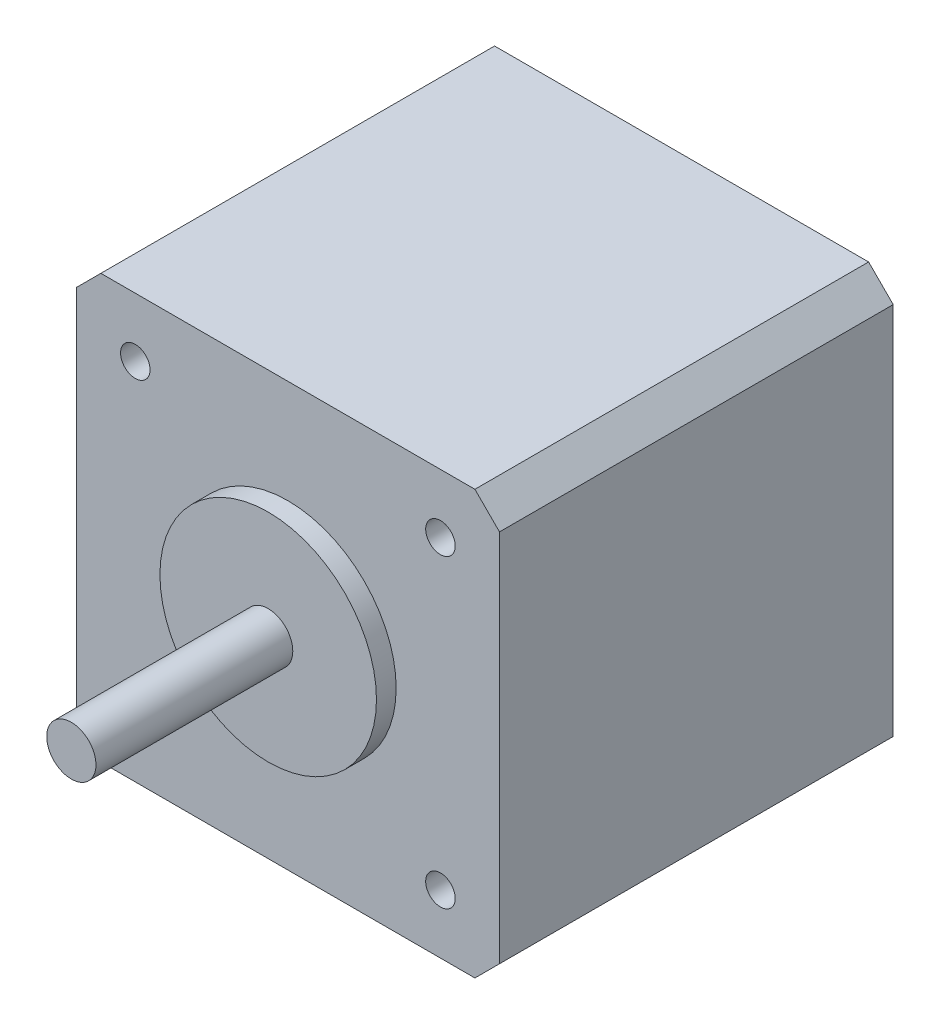
ISO-10303-21;
HEADER;
FILE_DESCRIPTION(('STEP AP214'),'2;1');
FILE_NAME('part.step','',(''),(''),'','','');
FILE_SCHEMA(('AUTOMOTIVE_DESIGN { 1 0 10303 214 1 1 1 1 }'));
ENDSEC;
DATA;
#1=APPLICATION_CONTEXT('core data for automotive mechanical design processes');
#2=APPLICATION_PROTOCOL_DEFINITION('international standard','automotive_design',2000,#1);
#3=PRODUCT_CONTEXT('',#1,'mechanical');
#4=PRODUCT('Part','Part','',(#3));
#5=PRODUCT_RELATED_PRODUCT_CATEGORY('part','',(#4));
#6=PRODUCT_DEFINITION_FORMATION('','',#4);
#7=PRODUCT_DEFINITION_CONTEXT('part definition',#1,'design');
#8=PRODUCT_DEFINITION('design','',#6,#7);
#9=PRODUCT_DEFINITION_SHAPE('','',#8);
#10=(LENGTH_UNIT() NAMED_UNIT(*) SI_UNIT(.MILLI.,.METRE.));
#11=(NAMED_UNIT(*) PLANE_ANGLE_UNIT() SI_UNIT($,.RADIAN.));
#12=(NAMED_UNIT(*) SI_UNIT($,.STERADIAN.) SOLID_ANGLE_UNIT());
#13=UNCERTAINTY_MEASURE_WITH_UNIT(LENGTH_MEASURE(1.E-05),#10,'distance_accuracy_value','');
#14=(GEOMETRIC_REPRESENTATION_CONTEXT(3) GLOBAL_UNCERTAINTY_ASSIGNED_CONTEXT((#13)) GLOBAL_UNIT_ASSIGNED_CONTEXT((#10,
#11,#12)) REPRESENTATION_CONTEXT('',''));
#15=CARTESIAN_POINT('',(0.,0.,0.));
#16=DIRECTION('',(0.,0.,1.));
#17=DIRECTION('',(1.,0.,0.));
#18=AXIS2_PLACEMENT_3D('',#15,#16,#17);
#19=CARTESIAN_POINT('',(0.,0.,42.));
#20=DIRECTION('',(0.,0.,1.));
#21=DIRECTION('',(1.,0.,0.));
#22=AXIS2_PLACEMENT_3D('',#19,#20,#21);
#23=PLANE('',#22);
#24=CARTESIAN_POINT('',(0.,0.,42.));
#25=DIRECTION('',(0.,0.,1.));
#26=DIRECTION('',(1.,0.,0.));
#27=AXIS2_PLACEMENT_3D('',#24,#25,#26);
#28=CIRCLE('',#27,11.);
#29=CARTESIAN_POINT('',(11.,0.,42.));
#30=VERTEX_POINT('',#29);
#31=EDGE_CURVE('E163',#30,#30,#28,.T.);
#32=ORIENTED_EDGE('',*,*,#31,.T.);
#33=EDGE_LOOP('',(#32));
#34=FACE_BOUND('',#33,.T.);
#35=CARTESIAN_POINT('',(0.,0.,42.));
#36=DIRECTION('',(0.,0.,1.));
#37=DIRECTION('',(1.,0.,0.));
#38=AXIS2_PLACEMENT_3D('',#35,#36,#37);
#39=CIRCLE('',#38,2.5);
#40=CARTESIAN_POINT('',(2.5,0.,42.));
#41=VERTEX_POINT('',#40);
#42=EDGE_CURVE('E174',#41,#41,#39,.T.);
#43=ORIENTED_EDGE('',*,*,#42,.F.);
#44=EDGE_LOOP('',(#43));
#45=FACE_BOUND('',#44,.T.);
#46=ADVANCED_FACE('F34',(#34,#45),#23,.T.);
#47=CARTESIAN_POINT('',(21.5,21.5,40.));
#48=DIRECTION('',(0.,0.,-1.));
#49=DIRECTION('',(-1.,0.,0.));
#50=AXIS2_PLACEMENT_3D('',#47,#48,#49);
#51=PLANE('',#50);
#52=CARTESIAN_POINT('',(-15.4999999999995,-15.5,40.));
#53=DIRECTION('',(0.,0.,1.));
#54=DIRECTION('',(1.,0.,0.));
#55=AXIS2_PLACEMENT_3D('',#52,#53,#54);
#56=CIRCLE('',#55,1.50000000000035);
#57=CARTESIAN_POINT('',(-13.9999999999992,-15.5,40.));
#58=VERTEX_POINT('',#57);
#59=EDGE_CURVE('E198',#58,#58,#56,.T.);
#60=ORIENTED_EDGE('',*,*,#59,.F.);
#61=EDGE_LOOP('',(#60));
#62=FACE_BOUND('',#61,.T.);
#63=CARTESIAN_POINT('',(15.5000000000005,-15.4999999999995,40.));
#64=DIRECTION('',(0.,0.,1.));
#65=DIRECTION('',(1.,0.,0.));
#66=AXIS2_PLACEMENT_3D('',#63,#64,#65);
#67=CIRCLE('',#66,1.50000000000035);
#68=CARTESIAN_POINT('',(17.0000000000008,-15.4999999999995,40.));
#69=VERTEX_POINT('',#68);
#70=EDGE_CURVE('E192',#69,#69,#67,.T.);
#71=ORIENTED_EDGE('',*,*,#70,.F.);
#72=EDGE_LOOP('',(#71));
#73=FACE_BOUND('',#72,.T.);
#74=CARTESIAN_POINT('',(15.5,15.5000000000005,40.));
#75=DIRECTION('',(0.,0.,1.));
#76=DIRECTION('',(1.,0.,0.));
#77=AXIS2_PLACEMENT_3D('',#74,#75,#76);
#78=CIRCLE('',#77,1.50000000000035);
#79=CARTESIAN_POINT('',(17.0000000000003,15.5000000000005,40.));
#80=VERTEX_POINT('',#79);
#81=EDGE_CURVE('E186',#80,#80,#78,.T.);
#82=ORIENTED_EDGE('',*,*,#81,.F.);
#83=EDGE_LOOP('',(#82));
#84=FACE_BOUND('',#83,.T.);
#85=CARTESIAN_POINT('',(-15.5,15.5,40.));
#86=DIRECTION('',(0.,0.,1.));
#87=DIRECTION('',(1.,0.,0.));
#88=AXIS2_PLACEMENT_3D('',#85,#86,#87);
#89=CIRCLE('',#88,1.50000000000035);
#90=CARTESIAN_POINT('',(-13.9999999999996,15.5,40.));
#91=VERTEX_POINT('',#90);
#92=EDGE_CURVE('E180',#91,#91,#89,.T.);
#93=ORIENTED_EDGE('',*,*,#92,.F.);
#94=EDGE_LOOP('',(#93));
#95=FACE_BOUND('',#94,.T.);
#96=DIRECTION('',(0.,-1.,0.));
#97=VECTOR('',#96,1.);
#98=CARTESIAN_POINT('',(-21.5,-21.5,40.));
#99=LINE('',#98,#97);
#100=CARTESIAN_POINT('',(-21.5,19.,40.));
#101=VERTEX_POINT('',#100);
#102=CARTESIAN_POINT('',(-21.5,-19.,40.));
#103=VERTEX_POINT('',#102);
#104=EDGE_CURVE('E167',#101,#103,#99,.T.);
#105=ORIENTED_EDGE('',*,*,#104,.T.);
#106=DIRECTION('',(-0.707106781186547,0.707106781186549,0.));
#107=VECTOR('',#106,1.);
#108=CARTESIAN_POINT('',(-19.,-21.5,40.));
#109=LINE('',#108,#107);
#110=CARTESIAN_POINT('',(-19.,-21.5,40.));
#111=VERTEX_POINT('',#110);
#112=EDGE_CURVE('E148',#103,#111,#109,.F.);
#113=ORIENTED_EDGE('',*,*,#112,.T.);
#114=DIRECTION('',(1.,0.,0.));
#115=VECTOR('',#114,1.);
#116=CARTESIAN_POINT('',(-21.5,-21.5,40.));
#117=LINE('',#116,#115);
#118=CARTESIAN_POINT('',(19.,-21.5,40.));
#119=VERTEX_POINT('',#118);
#120=EDGE_CURVE('E120',#111,#119,#117,.T.);
#121=ORIENTED_EDGE('',*,*,#120,.T.);
#122=DIRECTION('',(-0.707106781186549,-0.707106781186547,0.));
#123=VECTOR('',#122,1.);
#124=CARTESIAN_POINT('',(21.5,-19.,40.));
#125=LINE('',#124,#123);
#126=CARTESIAN_POINT('',(21.5,-19.,40.));
#127=VERTEX_POINT('',#126);
#128=EDGE_CURVE('E146',#119,#127,#125,.F.);
#129=ORIENTED_EDGE('',*,*,#128,.T.);
#130=DIRECTION('',(0.,1.,0.));
#131=VECTOR('',#130,1.);
#132=CARTESIAN_POINT('',(21.5,-21.5,40.));
#133=LINE('',#132,#131);
#134=CARTESIAN_POINT('',(21.5,19.,40.));
#135=VERTEX_POINT('',#134);
#136=EDGE_CURVE('E126',#127,#135,#133,.T.);
#137=ORIENTED_EDGE('',*,*,#136,.T.);
#138=DIRECTION('',(0.707106781186547,-0.707106781186549,0.));
#139=VECTOR('',#138,1.);
#140=CARTESIAN_POINT('',(19.,21.5,40.));
#141=LINE('',#140,#139);
#142=CARTESIAN_POINT('',(19.,21.5,40.));
#143=VERTEX_POINT('',#142);
#144=EDGE_CURVE('E55',#135,#143,#141,.F.);
#145=ORIENTED_EDGE('',*,*,#144,.T.);
#146=DIRECTION('',(-1.,0.,0.));
#147=VECTOR('',#146,1.);
#148=CARTESIAN_POINT('',(-21.5,21.5,40.));
#149=LINE('',#148,#147);
#150=CARTESIAN_POINT('',(-19.,21.5,40.));
#151=VERTEX_POINT('',#150);
#152=EDGE_CURVE('E129',#143,#151,#149,.T.);
#153=ORIENTED_EDGE('',*,*,#152,.T.);
#154=DIRECTION('',(0.707106781186549,0.707106781186547,0.));
#155=VECTOR('',#154,1.);
#156=CARTESIAN_POINT('',(-21.5,19.,40.));
#157=LINE('',#156,#155);
#158=EDGE_CURVE('E144',#151,#101,#157,.F.);
#159=ORIENTED_EDGE('',*,*,#158,.T.);
#160=EDGE_LOOP('',(#105,#113,#121,#129,#137,#145,#153,#159));
#161=FACE_BOUND('',#160,.T.);
#162=CARTESIAN_POINT('',(0.,0.,40.));
#163=DIRECTION('',(0.,0.,-1.));
#164=DIRECTION('',(-1.,0.,0.));
#165=AXIS2_PLACEMENT_3D('',#162,#163,#164);
#166=CIRCLE('',#165,11.);
#167=CARTESIAN_POINT('',(-11.,0.,40.));
#168=VERTEX_POINT('',#167);
#169=EDGE_CURVE('E11',#168,#168,#166,.F.);
#170=ORIENTED_EDGE('',*,*,#169,.F.);
#171=EDGE_LOOP('',(#170));
#172=FACE_BOUND('',#171,.T.);
#173=ADVANCED_FACE('F213',(#62,#73,#84,#95,#161,#172),#51,.F.);
#174=CARTESIAN_POINT('',(21.5,-21.5,40.));
#175=DIRECTION('',(-1.,0.,0.));
#176=DIRECTION('',(0.,0.,1.));
#177=AXIS2_PLACEMENT_3D('',#174,#175,#176);
#178=PLANE('',#177);
#179=ORIENTED_EDGE('',*,*,#136,.F.);
#180=DIRECTION('',(0.,0.,-1.));
#181=VECTOR('',#180,1.);
#182=CARTESIAN_POINT('',(21.5,-19.,40.));
#183=LINE('',#182,#181);
#184=CARTESIAN_POINT('',(21.5,-19.,0.));
#185=VERTEX_POINT('',#184);
#186=EDGE_CURVE('E152',#127,#185,#183,.T.);
#187=ORIENTED_EDGE('',*,*,#186,.T.);
#188=DIRECTION('',(0.,1.,0.));
#189=VECTOR('',#188,1.);
#190=CARTESIAN_POINT('',(21.5,-21.5,0.));
#191=LINE('',#190,#189);
#192=CARTESIAN_POINT('',(21.5,19.,0.));
#193=VERTEX_POINT('',#192);
#194=EDGE_CURVE('E162',#185,#193,#191,.T.);
#195=ORIENTED_EDGE('',*,*,#194,.T.);
#196=DIRECTION('',(0.,0.,1.));
#197=VECTOR('',#196,1.);
#198=CARTESIAN_POINT('',(21.5,19.,40.));
#199=LINE('',#198,#197);
#200=EDGE_CURVE('E150',#193,#135,#199,.T.);
#201=ORIENTED_EDGE('',*,*,#200,.T.);
#202=EDGE_LOOP('',(#179,#187,#195,#201));
#203=FACE_BOUND('',#202,.T.);
#204=ADVANCED_FACE('F216',(#203),#178,.F.);
#205=CARTESIAN_POINT('',(-21.5,21.5,40.));
#206=DIRECTION('',(0.,-1.,0.));
#207=DIRECTION('',(0.,0.,-1.));
#208=AXIS2_PLACEMENT_3D('',#205,#206,#207);
#209=PLANE('',#208);
#210=DIRECTION('',(-1.,0.,0.));
#211=VECTOR('',#210,1.);
#212=CARTESIAN_POINT('',(-21.5,21.5,0.));
#213=LINE('',#212,#211);
#214=CARTESIAN_POINT('',(19.,21.5,0.));
#215=VERTEX_POINT('',#214);
#216=CARTESIAN_POINT('',(-19.,21.5,0.));
#217=VERTEX_POINT('',#216);
#218=EDGE_CURVE('E131',#215,#217,#213,.T.);
#219=ORIENTED_EDGE('',*,*,#218,.T.);
#220=DIRECTION('',(0.,0.,1.));
#221=VECTOR('',#220,1.);
#222=CARTESIAN_POINT('',(-19.,21.5,40.));
#223=LINE('',#222,#221);
#224=EDGE_CURVE('E42',#217,#151,#223,.T.);
#225=ORIENTED_EDGE('',*,*,#224,.T.);
#226=ORIENTED_EDGE('',*,*,#152,.F.);
#227=DIRECTION('',(0.,0.,-1.));
#228=VECTOR('',#227,1.);
#229=CARTESIAN_POINT('',(19.,21.5,40.));
#230=LINE('',#229,#228);
#231=EDGE_CURVE('E155',#143,#215,#230,.T.);
#232=ORIENTED_EDGE('',*,*,#231,.T.);
#233=EDGE_LOOP('',(#219,#225,#226,#232));
#234=FACE_BOUND('',#233,.T.);
#235=ADVANCED_FACE('F159',(#234),#209,.F.);
#236=CARTESIAN_POINT('',(-21.5,-21.5,40.));
#237=DIRECTION('',(1.,0.,0.));
#238=DIRECTION('',(0.,0.,-1.));
#239=AXIS2_PLACEMENT_3D('',#236,#237,#238);
#240=PLANE('',#239);
#241=DIRECTION('',(0.,-1.,0.));
#242=VECTOR('',#241,1.);
#243=CARTESIAN_POINT('',(-21.5,-21.5,0.));
#244=LINE('',#243,#242);
#245=CARTESIAN_POINT('',(-21.5,19.,0.));
#246=VERTEX_POINT('',#245);
#247=CARTESIAN_POINT('',(-21.5,-19.,0.));
#248=VERTEX_POINT('',#247);
#249=EDGE_CURVE('E127',#246,#248,#244,.T.);
#250=ORIENTED_EDGE('',*,*,#249,.T.);
#251=DIRECTION('',(0.,0.,1.));
#252=VECTOR('',#251,1.);
#253=CARTESIAN_POINT('',(-21.5,-19.,40.));
#254=LINE('',#253,#252);
#255=EDGE_CURVE('E105',#248,#103,#254,.T.);
#256=ORIENTED_EDGE('',*,*,#255,.T.);
#257=ORIENTED_EDGE('',*,*,#104,.F.);
#258=DIRECTION('',(0.,0.,-1.));
#259=VECTOR('',#258,1.);
#260=CARTESIAN_POINT('',(-21.5,19.,40.));
#261=LINE('',#260,#259);
#262=EDGE_CURVE('E110',#101,#246,#261,.T.);
#263=ORIENTED_EDGE('',*,*,#262,.T.);
#264=EDGE_LOOP('',(#250,#256,#257,#263));
#265=FACE_BOUND('',#264,.T.);
#266=ADVANCED_FACE('F339',(#265),#240,.F.);
#267=CARTESIAN_POINT('',(-21.5,-21.5,40.));
#268=DIRECTION('',(0.,1.,0.));
#269=DIRECTION('',(0.,0.,1.));
#270=AXIS2_PLACEMENT_3D('',#267,#268,#269);
#271=PLANE('',#270);
#272=ORIENTED_EDGE('',*,*,#120,.F.);
#273=DIRECTION('',(0.,0.,-1.));
#274=VECTOR('',#273,1.);
#275=CARTESIAN_POINT('',(-19.,-21.5,40.));
#276=LINE('',#275,#274);
#277=CARTESIAN_POINT('',(-19.,-21.5,0.));
#278=VERTEX_POINT('',#277);
#279=EDGE_CURVE('E104',#111,#278,#276,.T.);
#280=ORIENTED_EDGE('',*,*,#279,.T.);
#281=DIRECTION('',(1.,0.,0.));
#282=VECTOR('',#281,1.);
#283=CARTESIAN_POINT('',(-21.5,-21.5,0.));
#284=LINE('',#283,#282);
#285=CARTESIAN_POINT('',(19.,-21.5,0.));
#286=VERTEX_POINT('',#285);
#287=EDGE_CURVE('E117',#278,#286,#284,.T.);
#288=ORIENTED_EDGE('',*,*,#287,.T.);
#289=DIRECTION('',(0.,0.,1.));
#290=VECTOR('',#289,1.);
#291=CARTESIAN_POINT('',(19.,-21.5,40.));
#292=LINE('',#291,#290);
#293=EDGE_CURVE('E122',#286,#119,#292,.T.);
#294=ORIENTED_EDGE('',*,*,#293,.T.);
#295=EDGE_LOOP('',(#272,#280,#288,#294));
#296=FACE_BOUND('',#295,.T.);
#297=ADVANCED_FACE('F116',(#296),#271,.F.);
#298=CARTESIAN_POINT('',(21.5,21.5,0.));
#299=DIRECTION('',(0.,0.,-1.));
#300=DIRECTION('',(-1.,0.,0.));
#301=AXIS2_PLACEMENT_3D('',#298,#299,#300);
#302=PLANE('',#301);
#303=ORIENTED_EDGE('',*,*,#287,.F.);
#304=DIRECTION('',(0.707106781186547,-0.707106781186549,0.));
#305=VECTOR('',#304,1.);
#306=CARTESIAN_POINT('',(-20.2500000000001,-20.2499999999999,0.));
#307=LINE('',#306,#305);
#308=EDGE_CURVE('E100',#278,#248,#307,.F.);
#309=ORIENTED_EDGE('',*,*,#308,.T.);
#310=ORIENTED_EDGE('',*,*,#249,.F.);
#311=DIRECTION('',(-0.707106781186549,-0.707106781186547,0.));
#312=VECTOR('',#311,1.);
#313=CARTESIAN_POINT('',(1.25000000000005,41.75,0.));
#314=LINE('',#313,#312);
#315=EDGE_CURVE('E137',#246,#217,#314,.F.);
#316=ORIENTED_EDGE('',*,*,#315,.T.);
#317=ORIENTED_EDGE('',*,*,#218,.F.);
#318=DIRECTION('',(-0.707106781186547,0.707106781186549,0.));
#319=VECTOR('',#318,1.);
#320=CARTESIAN_POINT('',(20.25,20.25,0.));
#321=LINE('',#320,#319);
#322=EDGE_CURVE('E121',#215,#193,#321,.F.);
#323=ORIENTED_EDGE('',*,*,#322,.T.);
#324=ORIENTED_EDGE('',*,*,#194,.F.);
#325=DIRECTION('',(0.707106781186549,0.707106781186547,0.));
#326=VECTOR('',#325,1.);
#327=CARTESIAN_POINT('',(41.75,1.24999999999994,0.));
#328=LINE('',#327,#326);
#329=EDGE_CURVE('E111',#185,#286,#328,.F.);
#330=ORIENTED_EDGE('',*,*,#329,.T.);
#331=EDGE_LOOP('',(#303,#309,#310,#316,#317,#323,#324,#330));
#332=FACE_BOUND('',#331,.T.);
#333=ADVANCED_FACE('F124',(#332),#302,.T.);
#334=CARTESIAN_POINT('',(-19.,-21.5,40.));
#335=DIRECTION('',(0.707106781186548,0.707106781186546,0.));
#336=DIRECTION('',(-0.707106781186547,0.707106781186549,0.));
#337=AXIS2_PLACEMENT_3D('',#334,#335,#336);
#338=PLANE('',#337);
#339=ORIENTED_EDGE('',*,*,#112,.F.);
#340=ORIENTED_EDGE('',*,*,#255,.F.);
#341=ORIENTED_EDGE('',*,*,#308,.F.);
#342=ORIENTED_EDGE('',*,*,#279,.F.);
#343=EDGE_LOOP('',(#339,#340,#341,#342));
#344=FACE_BOUND('',#343,.T.);
#345=ADVANCED_FACE('F103',(#344),#338,.F.);
#346=CARTESIAN_POINT('',(21.5,-19.,40.));
#347=DIRECTION('',(-0.707106781186546,0.707106781186548,0.));
#348=DIRECTION('',(-0.707106781186549,-0.707106781186547,0.));
#349=AXIS2_PLACEMENT_3D('',#346,#347,#348);
#350=PLANE('',#349);
#351=ORIENTED_EDGE('',*,*,#128,.F.);
#352=ORIENTED_EDGE('',*,*,#293,.F.);
#353=ORIENTED_EDGE('',*,*,#329,.F.);
#354=ORIENTED_EDGE('',*,*,#186,.F.);
#355=EDGE_LOOP('',(#351,#352,#353,#354));
#356=FACE_BOUND('',#355,.T.);
#357=ADVANCED_FACE('F366',(#356),#350,.F.);
#358=CARTESIAN_POINT('',(-21.5,19.,40.));
#359=DIRECTION('',(0.707106781186546,-0.707106781186548,0.));
#360=DIRECTION('',(0.707106781186549,0.707106781186547,0.));
#361=AXIS2_PLACEMENT_3D('',#358,#359,#360);
#362=PLANE('',#361);
#363=ORIENTED_EDGE('',*,*,#158,.F.);
#364=ORIENTED_EDGE('',*,*,#224,.F.);
#365=ORIENTED_EDGE('',*,*,#315,.F.);
#366=ORIENTED_EDGE('',*,*,#262,.F.);
#367=EDGE_LOOP('',(#363,#364,#365,#366));
#368=FACE_BOUND('',#367,.T.);
#369=ADVANCED_FACE('F239',(#368),#362,.F.);
#370=CARTESIAN_POINT('',(19.,21.5,40.));
#371=DIRECTION('',(-0.707106781186548,-0.707106781186546,0.));
#372=DIRECTION('',(0.707106781186547,-0.707106781186549,0.));
#373=AXIS2_PLACEMENT_3D('',#370,#371,#372);
#374=PLANE('',#373);
#375=ORIENTED_EDGE('',*,*,#144,.F.);
#376=ORIENTED_EDGE('',*,*,#200,.F.);
#377=ORIENTED_EDGE('',*,*,#322,.F.);
#378=ORIENTED_EDGE('',*,*,#231,.F.);
#379=EDGE_LOOP('',(#375,#376,#377,#378));
#380=FACE_BOUND('',#379,.T.);
#381=ADVANCED_FACE('F36',(#380),#374,.F.);
#382=CARTESIAN_POINT('',(0.,0.,42.));
#383=DIRECTION('',(0.,0.,-1.));
#384=DIRECTION('',(-1.,0.,0.));
#385=AXIS2_PLACEMENT_3D('',#382,#383,#384);
#386=CYLINDRICAL_SURFACE('',#385,11.);
#387=ORIENTED_EDGE('',*,*,#31,.F.);
#388=EDGE_LOOP('',(#387));
#389=FACE_BOUND('',#388,.T.);
#390=ORIENTED_EDGE('',*,*,#169,.T.);
#391=EDGE_LOOP('',(#390));
#392=FACE_BOUND('',#391,.T.);
#393=ADVANCED_FACE('F227',(#389,#392),#386,.T.);
#394=CARTESIAN_POINT('',(0.,0.,62.));
#395=DIRECTION('',(0.,0.,-1.));
#396=DIRECTION('',(-1.,0.,0.));
#397=AXIS2_PLACEMENT_3D('',#394,#395,#396);
#398=CYLINDRICAL_SURFACE('',#397,2.5);
#399=CARTESIAN_POINT('',(0.,0.,62.));
#400=DIRECTION('',(0.,0.,1.));
#401=DIRECTION('',(1.,0.,0.));
#402=AXIS2_PLACEMENT_3D('',#399,#400,#401);
#403=CIRCLE('',#402,2.5);
#404=CARTESIAN_POINT('',(2.5,0.,62.));
#405=VERTEX_POINT('',#404);
#406=EDGE_CURVE('E173',#405,#405,#403,.T.);
#407=ORIENTED_EDGE('',*,*,#406,.F.);
#408=EDGE_LOOP('',(#407));
#409=FACE_BOUND('',#408,.T.);
#410=ORIENTED_EDGE('',*,*,#42,.T.);
#411=EDGE_LOOP('',(#410));
#412=FACE_BOUND('',#411,.T.);
#413=ADVANCED_FACE('F229',(#409,#412),#398,.T.);
#414=CARTESIAN_POINT('',(0.,0.,62.));
#415=DIRECTION('',(0.,0.,1.));
#416=DIRECTION('',(1.,0.,0.));
#417=AXIS2_PLACEMENT_3D('',#414,#415,#416);
#418=PLANE('',#417);
#419=ORIENTED_EDGE('',*,*,#406,.T.);
#420=EDGE_LOOP('',(#419));
#421=FACE_BOUND('',#420,.T.);
#422=ADVANCED_FACE('F236',(#421),#418,.T.);
#423=CARTESIAN_POINT('',(-15.5,15.5,30.));
#424=DIRECTION('',(0.,0.,1.));
#425=DIRECTION('',(1.,0.,0.));
#426=AXIS2_PLACEMENT_3D('',#423,#424,#425);
#427=CYLINDRICAL_SURFACE('',#426,1.50000000000035);
#428=CARTESIAN_POINT('',(-15.5,15.5,30.));
#429=DIRECTION('',(0.,0.,1.));
#430=DIRECTION('',(1.,0.,0.));
#431=AXIS2_PLACEMENT_3D('',#428,#429,#430);
#432=CIRCLE('',#431,1.50000000000035);
#433=CARTESIAN_POINT('',(-13.9999999999996,15.5,30.));
#434=VERTEX_POINT('',#433);
#435=EDGE_CURVE('E177',#434,#434,#432,.T.);
#436=ORIENTED_EDGE('',*,*,#435,.F.);
#437=EDGE_LOOP('',(#436));
#438=FACE_BOUND('',#437,.T.);
#439=ORIENTED_EDGE('',*,*,#92,.T.);
#440=EDGE_LOOP('',(#439));
#441=FACE_BOUND('',#440,.T.);
#442=ADVANCED_FACE('F250',(#438,#441),#427,.F.);
#443=CARTESIAN_POINT('',(-15.5,15.5,30.));
#444=DIRECTION('',(0.,0.,1.));
#445=DIRECTION('',(1.,0.,0.));
#446=AXIS2_PLACEMENT_3D('',#443,#444,#445);
#447=PLANE('',#446);
#448=ORIENTED_EDGE('',*,*,#435,.T.);
#449=EDGE_LOOP('',(#448));
#450=FACE_BOUND('',#449,.T.);
#451=ADVANCED_FACE('F254',(#450),#447,.T.);
#452=CARTESIAN_POINT('',(15.5,15.5000000000005,30.));
#453=DIRECTION('',(0.,0.,1.));
#454=DIRECTION('',(1.,0.,0.));
#455=AXIS2_PLACEMENT_3D('',#452,#453,#454);
#456=CYLINDRICAL_SURFACE('',#455,1.50000000000035);
#457=CARTESIAN_POINT('',(15.5,15.5000000000005,30.));
#458=DIRECTION('',(0.,0.,1.));
#459=DIRECTION('',(1.,0.,0.));
#460=AXIS2_PLACEMENT_3D('',#457,#458,#459);
#461=CIRCLE('',#460,1.50000000000035);
#462=CARTESIAN_POINT('',(17.0000000000003,15.5000000000005,30.));
#463=VERTEX_POINT('',#462);
#464=EDGE_CURVE('E183',#463,#463,#461,.T.);
#465=ORIENTED_EDGE('',*,*,#464,.F.);
#466=EDGE_LOOP('',(#465));
#467=FACE_BOUND('',#466,.T.);
#468=ORIENTED_EDGE('',*,*,#81,.T.);
#469=EDGE_LOOP('',(#468));
#470=FACE_BOUND('',#469,.T.);
#471=ADVANCED_FACE('F258',(#467,#470),#456,.F.);
#472=CARTESIAN_POINT('',(15.5,15.5000000000005,30.));
#473=DIRECTION('',(0.,0.,1.));
#474=DIRECTION('',(1.,0.,0.));
#475=AXIS2_PLACEMENT_3D('',#472,#473,#474);
#476=PLANE('',#475);
#477=ORIENTED_EDGE('',*,*,#464,.T.);
#478=EDGE_LOOP('',(#477));
#479=FACE_BOUND('',#478,.T.);
#480=ADVANCED_FACE('F262',(#479),#476,.T.);
#481=CARTESIAN_POINT('',(15.5000000000005,-15.4999999999995,30.));
#482=DIRECTION('',(0.,0.,1.));
#483=DIRECTION('',(1.,0.,0.));
#484=AXIS2_PLACEMENT_3D('',#481,#482,#483);
#485=CYLINDRICAL_SURFACE('',#484,1.50000000000035);
#486=CARTESIAN_POINT('',(15.5000000000005,-15.4999999999995,30.));
#487=DIRECTION('',(0.,0.,1.));
#488=DIRECTION('',(1.,0.,0.));
#489=AXIS2_PLACEMENT_3D('',#486,#487,#488);
#490=CIRCLE('',#489,1.50000000000035);
#491=CARTESIAN_POINT('',(17.0000000000008,-15.4999999999995,30.));
#492=VERTEX_POINT('',#491);
#493=EDGE_CURVE('E189',#492,#492,#490,.T.);
#494=ORIENTED_EDGE('',*,*,#493,.F.);
#495=EDGE_LOOP('',(#494));
#496=FACE_BOUND('',#495,.T.);
#497=ORIENTED_EDGE('',*,*,#70,.T.);
#498=EDGE_LOOP('',(#497));
#499=FACE_BOUND('',#498,.T.);
#500=ADVANCED_FACE('F266',(#496,#499),#485,.F.);
#501=CARTESIAN_POINT('',(15.5000000000005,-15.4999999999995,30.));
#502=DIRECTION('',(0.,0.,1.));
#503=DIRECTION('',(1.,0.,0.));
#504=AXIS2_PLACEMENT_3D('',#501,#502,#503);
#505=PLANE('',#504);
#506=ORIENTED_EDGE('',*,*,#493,.T.);
#507=EDGE_LOOP('',(#506));
#508=FACE_BOUND('',#507,.T.);
#509=ADVANCED_FACE('F209',(#508),#505,.T.);
#510=CARTESIAN_POINT('',(-15.4999999999995,-15.5,30.));
#511=DIRECTION('',(0.,0.,1.));
#512=DIRECTION('',(1.,0.,0.));
#513=AXIS2_PLACEMENT_3D('',#510,#511,#512);
#514=CYLINDRICAL_SURFACE('',#513,1.50000000000035);
#515=CARTESIAN_POINT('',(-15.4999999999995,-15.5,30.));
#516=DIRECTION('',(0.,0.,1.));
#517=DIRECTION('',(1.,0.,0.));
#518=AXIS2_PLACEMENT_3D('',#515,#516,#517);
#519=CIRCLE('',#518,1.50000000000035);
#520=CARTESIAN_POINT('',(-13.9999999999992,-15.5,30.));
#521=VERTEX_POINT('',#520);
#522=EDGE_CURVE('E195',#521,#521,#519,.T.);
#523=ORIENTED_EDGE('',*,*,#522,.F.);
#524=EDGE_LOOP('',(#523));
#525=FACE_BOUND('',#524,.T.);
#526=ORIENTED_EDGE('',*,*,#59,.T.);
#527=EDGE_LOOP('',(#526));
#528=FACE_BOUND('',#527,.T.);
#529=ADVANCED_FACE('F206',(#525,#528),#514,.F.);
#530=CARTESIAN_POINT('',(-15.4999999999995,-15.5,30.));
#531=DIRECTION('',(0.,0.,1.));
#532=DIRECTION('',(1.,0.,0.));
#533=AXIS2_PLACEMENT_3D('',#530,#531,#532);
#534=PLANE('',#533);
#535=ORIENTED_EDGE('',*,*,#522,.T.);
#536=EDGE_LOOP('',(#535));
#537=FACE_BOUND('',#536,.T.);
#538=ADVANCED_FACE('F204',(#537),#534,.T.);
#539=CLOSED_SHELL('',(#46,#173,#204,#235,#266,#297,#333,#345,#357,#369,#381,#393,#413,#422,#442,
#451,#471,#480,#500,#509,#529,#538));
#540=MANIFOLD_SOLID_BREP('B2',#539);
#541=ADVANCED_BREP_SHAPE_REPRESENTATION('',(#18,#540),#14);
#542=SHAPE_DEFINITION_REPRESENTATION(#9,#541);
ENDSEC;
END-ISO-10303-21;
